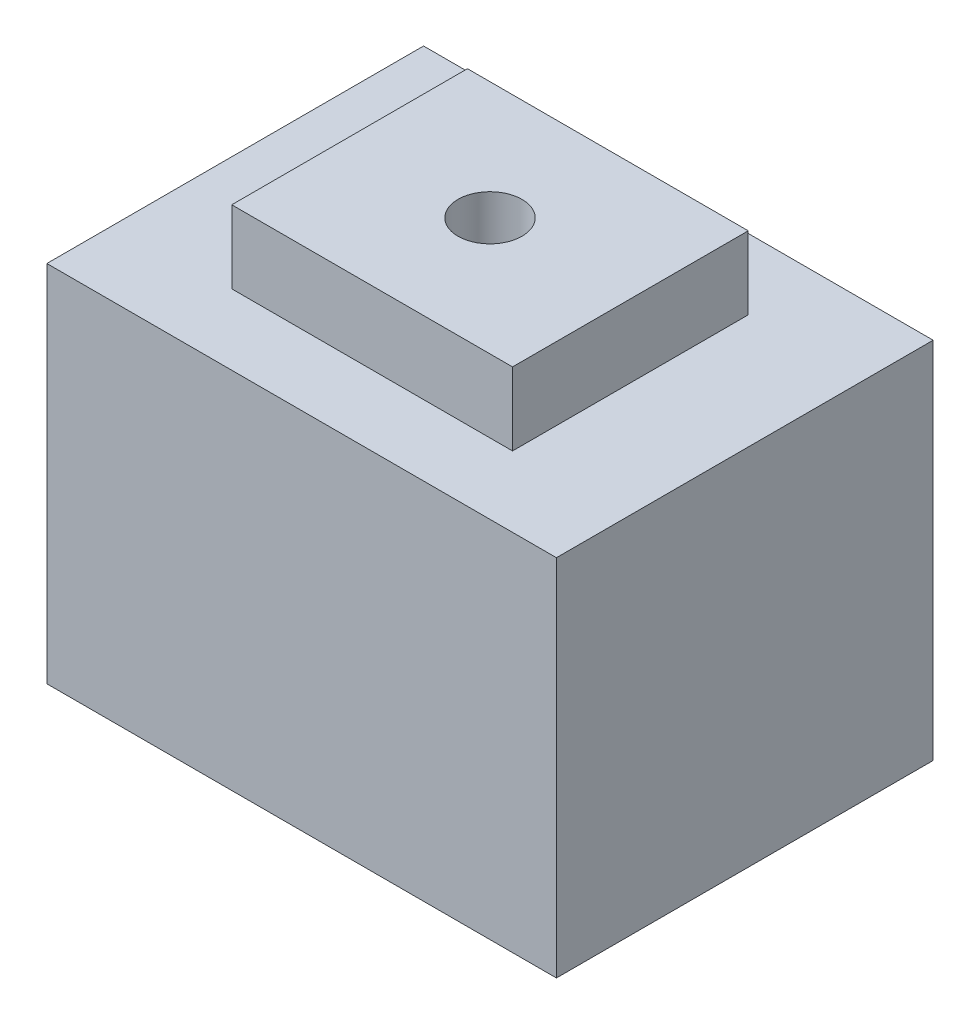
ISO-10303-21;
HEADER;
FILE_DESCRIPTION(('STEP AP214'),'2;1');
FILE_NAME('part.step','',(''),(''),'','','');
FILE_SCHEMA(('AUTOMOTIVE_DESIGN { 1 0 10303 214 1 1 1 1 }'));
ENDSEC;
DATA;
#1=APPLICATION_CONTEXT('core data for automotive mechanical design processes');
#2=APPLICATION_PROTOCOL_DEFINITION('international standard','automotive_design',2000,#1);
#3=PRODUCT_CONTEXT('',#1,'mechanical');
#4=PRODUCT('Part','Part','',(#3));
#5=PRODUCT_RELATED_PRODUCT_CATEGORY('part','',(#4));
#6=PRODUCT_DEFINITION_FORMATION('','',#4);
#7=PRODUCT_DEFINITION_CONTEXT('part definition',#1,'design');
#8=PRODUCT_DEFINITION('design','',#6,#7);
#9=PRODUCT_DEFINITION_SHAPE('','',#8);
#10=(LENGTH_UNIT() NAMED_UNIT(*) SI_UNIT(.MILLI.,.METRE.));
#11=(NAMED_UNIT(*) PLANE_ANGLE_UNIT() SI_UNIT($,.RADIAN.));
#12=(NAMED_UNIT(*) SI_UNIT($,.STERADIAN.) SOLID_ANGLE_UNIT());
#13=UNCERTAINTY_MEASURE_WITH_UNIT(LENGTH_MEASURE(1.E-05),#10,'distance_accuracy_value','');
#14=(GEOMETRIC_REPRESENTATION_CONTEXT(3) GLOBAL_UNCERTAINTY_ASSIGNED_CONTEXT((#13)) GLOBAL_UNIT_ASSIGNED_CONTEXT((#10,
#11,#12)) REPRESENTATION_CONTEXT('',''));
#15=CARTESIAN_POINT('',(0.,0.,0.));
#16=DIRECTION('',(0.,0.,1.));
#17=DIRECTION('',(1.,0.,0.));
#18=AXIS2_PLACEMENT_3D('',#15,#16,#17);
#19=CARTESIAN_POINT('',(0.,50.,0.));
#20=DIRECTION('',(0.,-1.,0.));
#21=DIRECTION('',(0.,0.,-1.));
#22=AXIS2_PLACEMENT_3D('',#19,#20,#21);
#23=PLANE('',#22);
#24=DIRECTION('',(0.,0.,-1.));
#25=VECTOR('',#24,1.);
#26=CARTESIAN_POINT('',(35.,50.,25.8732057416268));
#27=LINE('',#26,#25);
#28=CARTESIAN_POINT('',(35.,50.,25.8732057416268));
#29=VERTEX_POINT('',#28);
#30=CARTESIAN_POINT('',(35.,50.,-25.8732057416268));
#31=VERTEX_POINT('',#30);
#32=EDGE_CURVE('E131',#29,#31,#27,.T.);
#33=ORIENTED_EDGE('',*,*,#32,.T.);
#34=DIRECTION('',(-1.,0.,0.));
#35=VECTOR('',#34,1.);
#36=CARTESIAN_POINT('',(-35.,50.,-25.8732057416268));
#37=LINE('',#36,#35);
#38=CARTESIAN_POINT('',(-35.,50.,-25.8732057416268));
#39=VERTEX_POINT('',#38);
#40=EDGE_CURVE('E134',#31,#39,#37,.T.);
#41=ORIENTED_EDGE('',*,*,#40,.T.);
#42=DIRECTION('',(0.,0.,1.));
#43=VECTOR('',#42,1.);
#44=CARTESIAN_POINT('',(-35.,50.,25.8732057416268));
#45=LINE('',#44,#43);
#46=CARTESIAN_POINT('',(-35.,50.,25.8732057416268));
#47=VERTEX_POINT('',#46);
#48=EDGE_CURVE('E137',#39,#47,#45,.T.);
#49=ORIENTED_EDGE('',*,*,#48,.T.);
#50=DIRECTION('',(1.,0.,0.));
#51=VECTOR('',#50,1.);
#52=CARTESIAN_POINT('',(-35.,50.,25.8732057416268));
#53=LINE('',#52,#51);
#54=EDGE_CURVE('E139',#47,#29,#53,.T.);
#55=ORIENTED_EDGE('',*,*,#54,.T.);
#56=EDGE_LOOP('',(#33,#41,#49,#55));
#57=FACE_BOUND('',#56,.T.);
#58=DIRECTION('',(0.,0.,-1.));
#59=VECTOR('',#58,1.);
#60=CARTESIAN_POINT('',(19.284458541753,50.,-16.1899756594715));
#61=LINE('',#60,#59);
#62=CARTESIAN_POINT('',(19.284458541753,50.,16.1899756594715));
#63=VERTEX_POINT('',#62);
#64=CARTESIAN_POINT('',(19.284458541753,50.,-16.1899756594715));
#65=VERTEX_POINT('',#64);
#66=EDGE_CURVE('E121',#63,#65,#61,.T.);
#67=ORIENTED_EDGE('',*,*,#66,.F.);
#68=DIRECTION('',(1.,0.,0.));
#69=VECTOR('',#68,1.);
#70=CARTESIAN_POINT('',(-19.284458541753,50.,16.1899756594715));
#71=LINE('',#70,#69);
#72=CARTESIAN_POINT('',(-19.284458541753,50.,16.1899756594715));
#73=VERTEX_POINT('',#72);
#74=EDGE_CURVE('E118',#73,#63,#71,.T.);
#75=ORIENTED_EDGE('',*,*,#74,.F.);
#76=DIRECTION('',(0.,0.,1.));
#77=VECTOR('',#76,1.);
#78=CARTESIAN_POINT('',(-19.284458541753,50.,-16.1899756594715));
#79=LINE('',#78,#77);
#80=CARTESIAN_POINT('',(-19.284458541753,50.,-16.1899756594715));
#81=VERTEX_POINT('',#80);
#82=EDGE_CURVE('E56',#81,#73,#79,.T.);
#83=ORIENTED_EDGE('',*,*,#82,.F.);
#84=DIRECTION('',(-1.,0.,0.));
#85=VECTOR('',#84,1.);
#86=CARTESIAN_POINT('',(-19.284458541753,50.,-16.1899756594715));
#87=LINE('',#86,#85);
#88=EDGE_CURVE('E51',#65,#81,#87,.T.);
#89=ORIENTED_EDGE('',*,*,#88,.F.);
#90=EDGE_LOOP('',(#67,#75,#83,#89));
#91=FACE_BOUND('',#90,.T.);
#92=ADVANCED_FACE('F35',(#57,#91),#23,.F.);
#93=CARTESIAN_POINT('',(35.,50.,25.8732057416268));
#94=DIRECTION('',(-1.,0.,0.));
#95=DIRECTION('',(0.,0.,1.));
#96=AXIS2_PLACEMENT_3D('',#93,#94,#95);
#97=PLANE('',#96);
#98=DIRECTION('',(0.,0.,-1.));
#99=VECTOR('',#98,1.);
#100=CARTESIAN_POINT('',(35.,0.,25.8732057416268));
#101=LINE('',#100,#99);
#102=CARTESIAN_POINT('',(35.,0.,25.8732057416268));
#103=VERTEX_POINT('',#102);
#104=CARTESIAN_POINT('',(35.,0.,-25.8732057416268));
#105=VERTEX_POINT('',#104);
#106=EDGE_CURVE('E122',#103,#105,#101,.T.);
#107=ORIENTED_EDGE('',*,*,#106,.T.);
#108=DIRECTION('',(0.,-1.,0.));
#109=VECTOR('',#108,1.);
#110=CARTESIAN_POINT('',(35.,50.,-25.8732057416268));
#111=LINE('',#110,#109);
#112=EDGE_CURVE('E11',#31,#105,#111,.T.);
#113=ORIENTED_EDGE('',*,*,#112,.F.);
#114=ORIENTED_EDGE('',*,*,#32,.F.);
#115=DIRECTION('',(0.,-1.,0.));
#116=VECTOR('',#115,1.);
#117=CARTESIAN_POINT('',(35.,50.,25.8732057416268));
#118=LINE('',#117,#116);
#119=EDGE_CURVE('E140',#29,#103,#118,.T.);
#120=ORIENTED_EDGE('',*,*,#119,.T.);
#121=EDGE_LOOP('',(#107,#113,#114,#120));
#122=FACE_BOUND('',#121,.T.);
#123=ADVANCED_FACE('F37',(#122),#97,.F.);
#124=CARTESIAN_POINT('',(-35.,50.,-25.8732057416268));
#125=DIRECTION('',(0.,0.,1.));
#126=DIRECTION('',(1.,0.,0.));
#127=AXIS2_PLACEMENT_3D('',#124,#125,#126);
#128=PLANE('',#127);
#129=DIRECTION('',(-1.,0.,0.));
#130=VECTOR('',#129,1.);
#131=CARTESIAN_POINT('',(-35.,0.,-25.8732057416268));
#132=LINE('',#131,#130);
#133=CARTESIAN_POINT('',(-35.,0.,-25.8732057416268));
#134=VERTEX_POINT('',#133);
#135=EDGE_CURVE('E125',#105,#134,#132,.T.);
#136=ORIENTED_EDGE('',*,*,#135,.T.);
#137=DIRECTION('',(0.,-1.,0.));
#138=VECTOR('',#137,1.);
#139=CARTESIAN_POINT('',(-35.,50.,-25.8732057416268));
#140=LINE('',#139,#138);
#141=EDGE_CURVE('E44',#39,#134,#140,.T.);
#142=ORIENTED_EDGE('',*,*,#141,.F.);
#143=ORIENTED_EDGE('',*,*,#40,.F.);
#144=ORIENTED_EDGE('',*,*,#112,.T.);
#145=EDGE_LOOP('',(#136,#142,#143,#144));
#146=FACE_BOUND('',#145,.T.);
#147=ADVANCED_FACE('F171',(#146),#128,.F.);
#148=CARTESIAN_POINT('',(-35.,50.,25.8732057416268));
#149=DIRECTION('',(1.,0.,0.));
#150=DIRECTION('',(0.,0.,-1.));
#151=AXIS2_PLACEMENT_3D('',#148,#149,#150);
#152=PLANE('',#151);
#153=DIRECTION('',(0.,0.,1.));
#154=VECTOR('',#153,1.);
#155=CARTESIAN_POINT('',(-35.,0.,25.8732057416268));
#156=LINE('',#155,#154);
#157=CARTESIAN_POINT('',(-35.,0.,25.8732057416268));
#158=VERTEX_POINT('',#157);
#159=EDGE_CURVE('E143',#134,#158,#156,.T.);
#160=ORIENTED_EDGE('',*,*,#159,.T.);
#161=DIRECTION('',(0.,-1.,0.));
#162=VECTOR('',#161,1.);
#163=CARTESIAN_POINT('',(-35.,50.,25.8732057416268));
#164=LINE('',#163,#162);
#165=EDGE_CURVE('E148',#47,#158,#164,.T.);
#166=ORIENTED_EDGE('',*,*,#165,.F.);
#167=ORIENTED_EDGE('',*,*,#48,.F.);
#168=ORIENTED_EDGE('',*,*,#141,.T.);
#169=EDGE_LOOP('',(#160,#166,#167,#168));
#170=FACE_BOUND('',#169,.T.);
#171=ADVANCED_FACE('F156',(#170),#152,.F.);
#172=CARTESIAN_POINT('',(-35.,50.,25.8732057416268));
#173=DIRECTION('',(0.,0.,-1.));
#174=DIRECTION('',(-1.,0.,0.));
#175=AXIS2_PLACEMENT_3D('',#172,#173,#174);
#176=PLANE('',#175);
#177=DIRECTION('',(1.,0.,0.));
#178=VECTOR('',#177,1.);
#179=CARTESIAN_POINT('',(-35.,0.,25.8732057416268));
#180=LINE('',#179,#178);
#181=EDGE_CURVE('E135',#158,#103,#180,.T.);
#182=ORIENTED_EDGE('',*,*,#181,.T.);
#183=ORIENTED_EDGE('',*,*,#119,.F.);
#184=ORIENTED_EDGE('',*,*,#54,.F.);
#185=ORIENTED_EDGE('',*,*,#165,.T.);
#186=EDGE_LOOP('',(#182,#183,#184,#185));
#187=FACE_BOUND('',#186,.T.);
#188=ADVANCED_FACE('F165',(#187),#176,.F.);
#189=CARTESIAN_POINT('',(0.,0.,0.));
#190=DIRECTION('',(0.,-1.,0.));
#191=DIRECTION('',(0.,0.,-1.));
#192=AXIS2_PLACEMENT_3D('',#189,#190,#191);
#193=PLANE('',#192);
#194=CARTESIAN_POINT('',(0.,0.,0.));
#195=DIRECTION('',(0.,-1.,0.));
#196=DIRECTION('',(0.,0.,-1.));
#197=AXIS2_PLACEMENT_3D('',#194,#195,#196);
#198=CIRCLE('',#197,8.86590792937914);
#199=CARTESIAN_POINT('',(0.,0.,-8.86590792937914));
#200=VERTEX_POINT('',#199);
#201=EDGE_CURVE('E303',#200,#200,#198,.T.);
#202=ORIENTED_EDGE('',*,*,#201,.F.);
#203=EDGE_LOOP('',(#202));
#204=FACE_BOUND('',#203,.T.);
#205=ORIENTED_EDGE('',*,*,#106,.F.);
#206=ORIENTED_EDGE('',*,*,#181,.F.);
#207=ORIENTED_EDGE('',*,*,#159,.F.);
#208=ORIENTED_EDGE('',*,*,#135,.F.);
#209=EDGE_LOOP('',(#205,#206,#207,#208));
#210=FACE_BOUND('',#209,.T.);
#211=ADVANCED_FACE('F162',(#204,#210),#193,.T.);
#212=CARTESIAN_POINT('',(19.284458541753,60.,-16.1899756594715));
#213=DIRECTION('',(-1.,0.,0.));
#214=DIRECTION('',(0.,0.,1.));
#215=AXIS2_PLACEMENT_3D('',#212,#213,#214);
#216=PLANE('',#215);
#217=ORIENTED_EDGE('',*,*,#66,.T.);
#218=DIRECTION('',(0.,-1.,0.));
#219=VECTOR('',#218,1.);
#220=CARTESIAN_POINT('',(19.284458541753,60.,-16.1899756594715));
#221=LINE('',#220,#219);
#222=CARTESIAN_POINT('',(19.284458541753,60.,-16.1899756594715));
#223=VERTEX_POINT('',#222);
#224=EDGE_CURVE('E102',#223,#65,#221,.T.);
#225=ORIENTED_EDGE('',*,*,#224,.F.);
#226=DIRECTION('',(0.,0.,-1.));
#227=VECTOR('',#226,1.);
#228=CARTESIAN_POINT('',(19.284458541753,60.,-16.1899756594715));
#229=LINE('',#228,#227);
#230=CARTESIAN_POINT('',(19.284458541753,60.,16.1899756594715));
#231=VERTEX_POINT('',#230);
#232=EDGE_CURVE('E109',#231,#223,#229,.T.);
#233=ORIENTED_EDGE('',*,*,#232,.F.);
#234=DIRECTION('',(0.,-1.,0.));
#235=VECTOR('',#234,1.);
#236=CARTESIAN_POINT('',(19.284458541753,60.,16.1899756594715));
#237=LINE('',#236,#235);
#238=EDGE_CURVE('E312',#231,#63,#237,.T.);
#239=ORIENTED_EDGE('',*,*,#238,.T.);
#240=EDGE_LOOP('',(#217,#225,#233,#239));
#241=FACE_BOUND('',#240,.T.);
#242=ADVANCED_FACE('F120',(#241),#216,.F.);
#243=CARTESIAN_POINT('',(-19.284458541753,60.,-16.1899756594715));
#244=DIRECTION('',(0.,0.,1.));
#245=DIRECTION('',(1.,0.,0.));
#246=AXIS2_PLACEMENT_3D('',#243,#244,#245);
#247=PLANE('',#246);
#248=ORIENTED_EDGE('',*,*,#88,.T.);
#249=DIRECTION('',(0.,-1.,0.));
#250=VECTOR('',#249,1.);
#251=CARTESIAN_POINT('',(-19.284458541753,60.,-16.1899756594715));
#252=LINE('',#251,#250);
#253=CARTESIAN_POINT('',(-19.284458541753,60.,-16.1899756594715));
#254=VERTEX_POINT('',#253);
#255=EDGE_CURVE('E105',#254,#81,#252,.T.);
#256=ORIENTED_EDGE('',*,*,#255,.F.);
#257=DIRECTION('',(-1.,0.,0.));
#258=VECTOR('',#257,1.);
#259=CARTESIAN_POINT('',(-19.284458541753,60.,-16.1899756594715));
#260=LINE('',#259,#258);
#261=EDGE_CURVE('E98',#223,#254,#260,.T.);
#262=ORIENTED_EDGE('',*,*,#261,.F.);
#263=ORIENTED_EDGE('',*,*,#224,.T.);
#264=EDGE_LOOP('',(#248,#256,#262,#263));
#265=FACE_BOUND('',#264,.T.);
#266=ADVANCED_FACE('F100',(#265),#247,.F.);
#267=CARTESIAN_POINT('',(-19.284458541753,60.,-16.1899756594715));
#268=DIRECTION('',(1.,0.,0.));
#269=DIRECTION('',(0.,0.,-1.));
#270=AXIS2_PLACEMENT_3D('',#267,#268,#269);
#271=PLANE('',#270);
#272=ORIENTED_EDGE('',*,*,#82,.T.);
#273=DIRECTION('',(0.,-1.,0.));
#274=VECTOR('',#273,1.);
#275=CARTESIAN_POINT('',(-19.284458541753,60.,16.1899756594715));
#276=LINE('',#275,#274);
#277=CARTESIAN_POINT('',(-19.284458541753,60.,16.1899756594715));
#278=VERTEX_POINT('',#277);
#279=EDGE_CURVE('E127',#278,#73,#276,.T.);
#280=ORIENTED_EDGE('',*,*,#279,.F.);
#281=DIRECTION('',(0.,0.,1.));
#282=VECTOR('',#281,1.);
#283=CARTESIAN_POINT('',(-19.284458541753,60.,-16.1899756594715));
#284=LINE('',#283,#282);
#285=EDGE_CURVE('E108',#254,#278,#284,.T.);
#286=ORIENTED_EDGE('',*,*,#285,.F.);
#287=ORIENTED_EDGE('',*,*,#255,.T.);
#288=EDGE_LOOP('',(#272,#280,#286,#287));
#289=FACE_BOUND('',#288,.T.);
#290=ADVANCED_FACE('F210',(#289),#271,.F.);
#291=CARTESIAN_POINT('',(-19.284458541753,60.,16.1899756594715));
#292=DIRECTION('',(0.,0.,-1.));
#293=DIRECTION('',(-1.,0.,0.));
#294=AXIS2_PLACEMENT_3D('',#291,#292,#293);
#295=PLANE('',#294);
#296=ORIENTED_EDGE('',*,*,#74,.T.);
#297=ORIENTED_EDGE('',*,*,#238,.F.);
#298=DIRECTION('',(1.,0.,0.));
#299=VECTOR('',#298,1.);
#300=CARTESIAN_POINT('',(-19.284458541753,60.,16.1899756594715));
#301=LINE('',#300,#299);
#302=EDGE_CURVE('E114',#278,#231,#301,.T.);
#303=ORIENTED_EDGE('',*,*,#302,.F.);
#304=ORIENTED_EDGE('',*,*,#279,.T.);
#305=EDGE_LOOP('',(#296,#297,#303,#304));
#306=FACE_BOUND('',#305,.T.);
#307=ADVANCED_FACE('F216',(#306),#295,.F.);
#308=CARTESIAN_POINT('',(0.,60.,0.));
#309=DIRECTION('',(0.,1.,0.));
#310=DIRECTION('',(0.,0.,1.));
#311=AXIS2_PLACEMENT_3D('',#308,#309,#310);
#312=PLANE('',#311);
#313=CARTESIAN_POINT('',(0.,60.,0.));
#314=DIRECTION('',(0.,1.,0.));
#315=DIRECTION('',(0.,0.,1.));
#316=AXIS2_PLACEMENT_3D('',#313,#314,#315);
#317=CIRCLE('',#316,4.3943761482645);
#318=CARTESIAN_POINT('',(0.,60.,4.3943761482645));
#319=VERTEX_POINT('',#318);
#320=EDGE_CURVE('E301',#319,#319,#317,.T.);
#321=ORIENTED_EDGE('',*,*,#320,.F.);
#322=EDGE_LOOP('',(#321));
#323=FACE_BOUND('',#322,.T.);
#324=ORIENTED_EDGE('',*,*,#232,.T.);
#325=ORIENTED_EDGE('',*,*,#261,.T.);
#326=ORIENTED_EDGE('',*,*,#285,.T.);
#327=ORIENTED_EDGE('',*,*,#302,.T.);
#328=EDGE_LOOP('',(#324,#325,#326,#327));
#329=FACE_BOUND('',#328,.T.);
#330=ADVANCED_FACE('F112',(#323,#329),#312,.T.);
#331=CARTESIAN_POINT('',(0.,40.,0.));
#332=DIRECTION('',(0.,-1.,0.));
#333=DIRECTION('',(0.,0.,-1.));
#334=AXIS2_PLACEMENT_3D('',#331,#332,#333);
#335=CYLINDRICAL_SURFACE('',#334,8.86590792937914);
#336=CARTESIAN_POINT('',(0.,40.,0.));
#337=DIRECTION('',(0.,-1.,0.));
#338=DIRECTION('',(0.,0.,-1.));
#339=AXIS2_PLACEMENT_3D('',#336,#337,#338);
#340=CIRCLE('',#339,8.86590792937914);
#341=CARTESIAN_POINT('',(0.,40.,-8.86590792937914));
#342=VERTEX_POINT('',#341);
#343=EDGE_CURVE('E305',#342,#342,#340,.T.);
#344=ORIENTED_EDGE('',*,*,#343,.F.);
#345=EDGE_LOOP('',(#344));
#346=FACE_BOUND('',#345,.T.);
#347=ORIENTED_EDGE('',*,*,#201,.T.);
#348=EDGE_LOOP('',(#347));
#349=FACE_BOUND('',#348,.T.);
#350=ADVANCED_FACE('F230',(#346,#349),#335,.F.);
#351=CARTESIAN_POINT('',(0.,40.,0.));
#352=DIRECTION('',(0.,-1.,0.));
#353=DIRECTION('',(0.,0.,-1.));
#354=AXIS2_PLACEMENT_3D('',#351,#352,#353);
#355=PLANE('',#354);
#356=CARTESIAN_POINT('',(0.,40.,0.));
#357=DIRECTION('',(0.,-1.,0.));
#358=DIRECTION('',(0.,0.,-1.));
#359=AXIS2_PLACEMENT_3D('',#356,#357,#358);
#360=CIRCLE('',#359,4.3943761482645);
#361=CARTESIAN_POINT('',(0.,40.,-4.3943761482645));
#362=VERTEX_POINT('',#361);
#363=EDGE_CURVE('E39',#362,#362,#360,.T.);
#364=ORIENTED_EDGE('',*,*,#363,.F.);
#365=EDGE_LOOP('',(#364));
#366=FACE_BOUND('',#365,.T.);
#367=ORIENTED_EDGE('',*,*,#343,.T.);
#368=EDGE_LOOP('',(#367));
#369=FACE_BOUND('',#368,.T.);
#370=ADVANCED_FACE('F238',(#366,#369),#355,.T.);
#371=CARTESIAN_POINT('',(0.,0.,0.));
#372=DIRECTION('',(0.,1.,0.));
#373=DIRECTION('',(0.,0.,1.));
#374=AXIS2_PLACEMENT_3D('',#371,#372,#373);
#375=CYLINDRICAL_SURFACE('',#374,4.3943761482645);
#376=ORIENTED_EDGE('',*,*,#363,.T.);
#377=EDGE_LOOP('',(#376));
#378=FACE_BOUND('',#377,.T.);
#379=ORIENTED_EDGE('',*,*,#320,.T.);
#380=EDGE_LOOP('',(#379));
#381=FACE_BOUND('',#380,.T.);
#382=ADVANCED_FACE('F245',(#378,#381),#375,.F.);
#383=CLOSED_SHELL('',(#92,#123,#147,#171,#188,#211,#242,#266,#290,#307,#330,#350,#370,#382));
#384=MANIFOLD_SOLID_BREP('B2',#383);
#385=ADVANCED_BREP_SHAPE_REPRESENTATION('',(#18,#384),#14);
#386=SHAPE_DEFINITION_REPRESENTATION(#9,#385);
ENDSEC;
END-ISO-10303-21;
